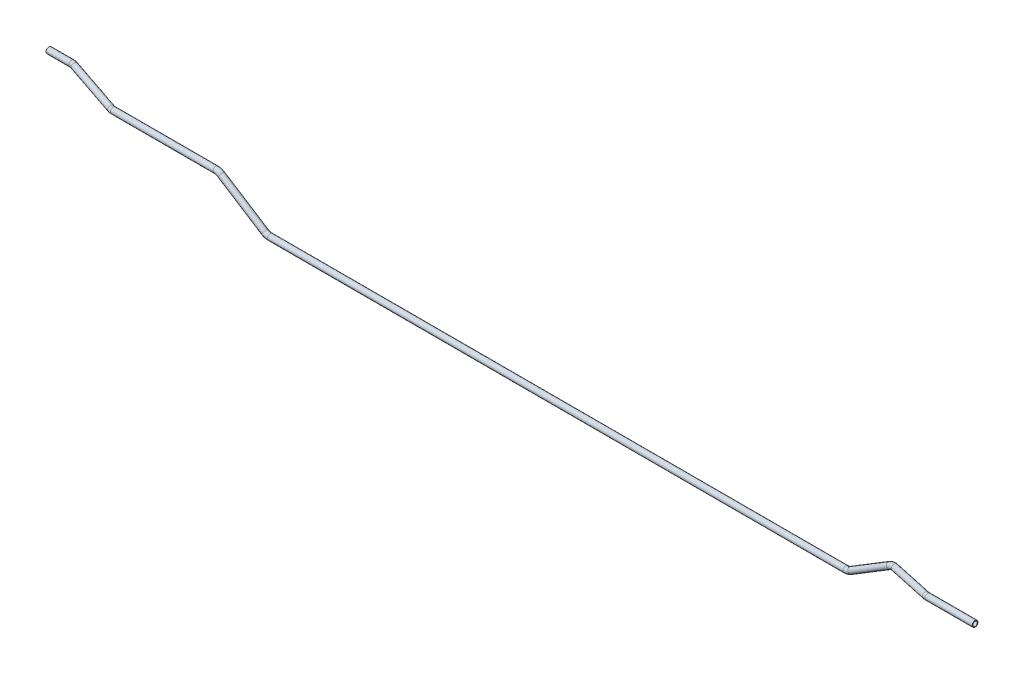
ISO-10303-21;
HEADER;
FILE_DESCRIPTION(('STEP AP214'),'2;1');
FILE_NAME('part.step','',(''),(''),'','','');
FILE_SCHEMA(('AUTOMOTIVE_DESIGN { 1 0 10303 214 1 1 1 1 }'));
ENDSEC;
DATA;
#1=APPLICATION_CONTEXT('core data for automotive mechanical design processes');
#2=APPLICATION_PROTOCOL_DEFINITION('international standard','automotive_design',2000,#1);
#3=PRODUCT_CONTEXT('',#1,'mechanical');
#4=PRODUCT('Part','Part','',(#3));
#5=PRODUCT_RELATED_PRODUCT_CATEGORY('part','',(#4));
#6=PRODUCT_DEFINITION_FORMATION('','',#4);
#7=PRODUCT_DEFINITION_CONTEXT('part definition',#1,'design');
#8=PRODUCT_DEFINITION('design','',#6,#7);
#9=PRODUCT_DEFINITION_SHAPE('','',#8);
#10=(LENGTH_UNIT() NAMED_UNIT(*) SI_UNIT(.MILLI.,.METRE.));
#11=(NAMED_UNIT(*) PLANE_ANGLE_UNIT() SI_UNIT($,.RADIAN.));
#12=(NAMED_UNIT(*) SI_UNIT($,.STERADIAN.) SOLID_ANGLE_UNIT());
#13=UNCERTAINTY_MEASURE_WITH_UNIT(LENGTH_MEASURE(1.E-05),#10,'distance_accuracy_value','');
#14=(GEOMETRIC_REPRESENTATION_CONTEXT(3) GLOBAL_UNCERTAINTY_ASSIGNED_CONTEXT((#13)) GLOBAL_UNIT_ASSIGNED_CONTEXT((#10,
#11,#12)) REPRESENTATION_CONTEXT('',''));
#15=CARTESIAN_POINT('',(0.,0.,0.));
#16=DIRECTION('',(0.,0.,1.));
#17=DIRECTION('',(1.,0.,0.));
#18=AXIS2_PLACEMENT_3D('',#15,#16,#17);
#19=CARTESIAN_POINT('',(1850.24890924357,-30.,39.4999999999999));
#20=DIRECTION('',(1.,0.,0.));
#21=DIRECTION('',(0.,0.,-1.));
#22=AXIS2_PLACEMENT_3D('',#19,#20,#21);
#23=CYLINDRICAL_SURFACE('',#22,6.);
#24=CARTESIAN_POINT('',(1850.24890924357,-30.,39.4999999999999));
#25=DIRECTION('',(1.,0.,0.));
#26=DIRECTION('',(0.,0.0602087645134184,-0.9981858066892));
#27=AXIS2_PLACEMENT_3D('',#24,#25,#26);
#28=CIRCLE('',#27,6.);
#29=CARTESIAN_POINT('',(1850.24890924357,-30.,45.4999999999999));
#30=VERTEX_POINT('',#29);
#31=EDGE_CURVE('E49',#30,#30,#28,.T.);
#32=ORIENTED_EDGE('',*,*,#31,.T.);
#33=EDGE_LOOP('',(#32));
#34=FACE_BOUND('',#33,.T.);
#35=CARTESIAN_POINT('',(1948.,-30.,39.4999999999999));
#36=DIRECTION('',(1.,0.,0.));
#37=DIRECTION('',(0.,0.0602087645134184,-0.9981858066892));
#38=AXIS2_PLACEMENT_3D('',#35,#36,#37);
#39=CIRCLE('',#38,6.);
#40=CARTESIAN_POINT('',(1948.,-29.6387474129195,33.5108851598647));
#41=VERTEX_POINT('',#40);
#42=EDGE_CURVE('E10',#41,#41,#39,.T.);
#43=ORIENTED_EDGE('',*,*,#42,.F.);
#44=EDGE_LOOP('',(#43));
#45=FACE_BOUND('',#44,.T.);
#46=ADVANCED_FACE('F39',(#34,#45),#23,.T.);
#47=CARTESIAN_POINT('',(1850.24890924357,-30.,39.4999999999999));
#48=DIRECTION('',(1.,0.,0.));
#49=DIRECTION('',(0.,0.,-1.));
#50=AXIS2_PLACEMENT_3D('',#47,#48,#49);
#51=CYLINDRICAL_SURFACE('',#50,4.5);
#52=CARTESIAN_POINT('',(1850.24890924357,-30.,39.4999999999999));
#53=DIRECTION('',(1.,0.,0.));
#54=DIRECTION('',(0.,0.0602087645134184,-0.9981858066892));
#55=AXIS2_PLACEMENT_3D('',#52,#53,#54);
#56=CIRCLE('',#55,4.5);
#57=CARTESIAN_POINT('',(1850.24890924357,-30.,43.9999999999999));
#58=VERTEX_POINT('',#57);
#59=EDGE_CURVE('E53',#58,#58,#56,.T.);
#60=ORIENTED_EDGE('',*,*,#59,.F.);
#61=EDGE_LOOP('',(#60));
#62=FACE_BOUND('',#61,.T.);
#63=CARTESIAN_POINT('',(1948.,-30.,39.4999999999999));
#64=DIRECTION('',(1.,0.,0.));
#65=DIRECTION('',(0.,0.0602087645134184,-0.9981858066892));
#66=AXIS2_PLACEMENT_3D('',#63,#64,#65);
#67=CIRCLE('',#66,4.5);
#68=CARTESIAN_POINT('',(1948.,-29.7290605596896,35.0081638698985));
#69=VERTEX_POINT('',#68);
#70=EDGE_CURVE('E45',#69,#69,#67,.T.);
#71=ORIENTED_EDGE('',*,*,#70,.T.);
#72=EDGE_LOOP('',(#71));
#73=FACE_BOUND('',#72,.T.);
#74=ADVANCED_FACE('F237',(#62,#73),#51,.F.);
#75=CARTESIAN_POINT('',(1850.24890924357,-30.,18.5));
#76=DIRECTION('',(0.,1.,0.));
#77=DIRECTION('',(0.,0.,1.));
#78=AXIS2_PLACEMENT_3D('',#75,#76,#77);
#79=TOROIDAL_SURFACE('',#78,20.9999999999999,6.);
#80=CARTESIAN_POINT('',(1845.80208895644,-30.,39.0237859405626));
#81=DIRECTION('',(0.977323140026797,0.,0.211753347005807));
#82=DIRECTION('',(0.211369185500129,0.0602087645134184,-0.97555008692367));
#83=AXIS2_PLACEMENT_3D('',#80,#81,#82);
#84=CIRCLE('',#83,6.);
#85=CARTESIAN_POINT('',(1844.53156887441,-30.,44.8877247807234));
#86=VERTEX_POINT('',#85);
#87=EDGE_CURVE('E58',#86,#86,#84,.T.);
#88=CARTESIAN_POINT('',(1850.24890924357,-30.,18.5));
#89=DIRECTION('',(0.,1.,0.));
#90=DIRECTION('',(0.,0.,1.));
#91=AXIS2_PLACEMENT_3D('',#88,#89,#90);
#92=CIRCLE('',#91,26.9999999999999);
#93=EDGE_CURVE('',#86,#30,#92,.T.);
#94=ORIENTED_EDGE('',*,*,#87,.T.);
#95=ORIENTED_EDGE('',*,*,#31,.F.);
#96=ORIENTED_EDGE('',*,*,#93,.T.);
#97=ORIENTED_EDGE('',*,*,#93,.F.);
#98=EDGE_LOOP('',(#94,#96,#95,#97));
#99=FACE_BOUND('',#98,.T.);
#100=ADVANCED_FACE('F233',(#99),#79,.T.);
#101=CARTESIAN_POINT('',(1850.24890924357,-30.,18.5));
#102=DIRECTION('',(0.,1.,0.));
#103=DIRECTION('',(0.,0.,1.));
#104=AXIS2_PLACEMENT_3D('',#101,#102,#103);
#105=TOROIDAL_SURFACE('',#104,20.9999999999999,4.5);
#106=CARTESIAN_POINT('',(1845.80208895644,-30.,39.0237859405626));
#107=DIRECTION('',(0.977323140026797,0.,0.211753347005807));
#108=DIRECTION('',(0.211369185500129,0.0602087645134184,-0.97555008692367));
#109=AXIS2_PLACEMENT_3D('',#106,#107,#108);
#110=CIRCLE('',#109,4.5);
#111=CARTESIAN_POINT('',(1844.84919889492,-30.,43.4217400706832));
#112=VERTEX_POINT('',#111);
#113=EDGE_CURVE('E61',#112,#112,#110,.T.);
#114=CARTESIAN_POINT('',(1850.24890924357,-30.,18.5));
#115=DIRECTION('',(0.,1.,0.));
#116=DIRECTION('',(0.,0.,1.));
#117=AXIS2_PLACEMENT_3D('',#114,#115,#116);
#118=CIRCLE('',#117,25.4999999999999);
#119=EDGE_CURVE('',#112,#58,#118,.T.);
#120=ORIENTED_EDGE('',*,*,#113,.F.);
#121=ORIENTED_EDGE('',*,*,#59,.T.);
#122=ORIENTED_EDGE('',*,*,#119,.T.);
#123=ORIENTED_EDGE('',*,*,#119,.F.);
#124=EDGE_LOOP('',(#120,#122,#121,#123));
#125=FACE_BOUND('',#124,.T.);
#126=ADVANCED_FACE('F230',(#125),#105,.F.);
#127=CARTESIAN_POINT('',(1764.1760204353,-30.,21.3381377609813));
#128=DIRECTION('',(0.977323140026798,0.,0.211753347005805));
#129=DIRECTION('',(0.211753347005805,0.,-0.977323140026798));
#130=AXIS2_PLACEMENT_3D('',#127,#128,#129);
#131=CYLINDRICAL_SURFACE('',#130,6.);
#132=CARTESIAN_POINT('',(1764.1760204353,-30.,21.3381377609813));
#133=DIRECTION('',(0.977323140026797,0.,0.211753347005807));
#134=DIRECTION('',(0.211369185500129,0.0602087645134184,-0.97555008692367));
#135=AXIS2_PLACEMENT_3D('',#132,#133,#134);
#136=CIRCLE('',#135,6.);
#137=CARTESIAN_POINT('',(1764.59199791712,-24.3307000595159,19.4182416910231));
#138=VERTEX_POINT('',#137);
#139=EDGE_CURVE('E64',#138,#138,#136,.T.);
#140=ORIENTED_EDGE('',*,*,#139,.T.);
#141=EDGE_LOOP('',(#140));
#142=FACE_BOUND('',#141,.T.);
#143=ORIENTED_EDGE('',*,*,#87,.F.);
#144=EDGE_LOOP('',(#143));
#145=FACE_BOUND('',#144,.T.);
#146=ADVANCED_FACE('F226',(#142,#145),#131,.T.);
#147=CARTESIAN_POINT('',(1764.1760204353,-30.,21.3381377609813));
#148=DIRECTION('',(0.977323140026798,0.,0.211753347005805));
#149=DIRECTION('',(0.211753347005805,0.,-0.977323140026798));
#150=AXIS2_PLACEMENT_3D('',#147,#148,#149);
#151=CYLINDRICAL_SURFACE('',#150,4.5);
#152=CARTESIAN_POINT('',(1764.1760204353,-30.,21.3381377609813));
#153=DIRECTION('',(0.977323140026797,0.,0.211753347005807));
#154=DIRECTION('',(0.211369185500129,0.0602087645134184,-0.97555008692367));
#155=AXIS2_PLACEMENT_3D('',#152,#153,#154);
#156=CIRCLE('',#155,4.5);
#157=CARTESIAN_POINT('',(1764.48800354667,-25.7480250446369,19.8982157085126));
#158=VERTEX_POINT('',#157);
#159=EDGE_CURVE('E67',#158,#158,#156,.T.);
#160=ORIENTED_EDGE('',*,*,#159,.F.);
#161=EDGE_LOOP('',(#160));
#162=FACE_BOUND('',#161,.T.);
#163=ORIENTED_EDGE('',*,*,#113,.T.);
#164=EDGE_LOOP('',(#163));
#165=FACE_BOUND('',#164,.T.);
#166=ADVANCED_FACE('F223',(#162,#165),#151,.F.);
#167=CARTESIAN_POINT('',(1762.72009924891,-49.8425497916947,28.057774005835));
#168=DIRECTION('',(0.200082206262887,-0.327407246612003,-0.923456336597959));
#169=DIRECTION('',(0.,0.942514822087113,-0.334164346012703));
#170=AXIS2_PLACEMENT_3D('',#167,#168,#169);
#171=TOROIDAL_SURFACE('',#170,20.9999999999999,6.);
#172=CARTESIAN_POINT('',(1752.60783662448,-33.2952109517084,20.));
#173=DIRECTION('',(0.853281833651957,0.521450009453978,0.));
#174=DIRECTION('',(0.,0.,-1.));
#175=AXIS2_PLACEMENT_3D('',#172,#173,#174);
#176=CIRCLE('',#175,6.);
#177=CARTESIAN_POINT('',(1749.71861873178,-28.5673998545695,17.6977788554757));
#178=VERTEX_POINT('',#177);
#179=EDGE_CURVE('E70',#178,#178,#176,.T.);
#180=CARTESIAN_POINT('',(1762.72009924891,-49.8425497916947,28.057774005835));
#181=DIRECTION('',(0.200082206262887,-0.327407246612003,-0.923456336597959));
#182=DIRECTION('',(0.,0.942514822087113,-0.334164346012703));
#183=AXIS2_PLACEMENT_3D('',#180,#181,#182);
#184=CIRCLE('',#183,26.9999999999999);
#185=EDGE_CURVE('',#178,#138,#184,.T.);
#186=ORIENTED_EDGE('',*,*,#179,.T.);
#187=ORIENTED_EDGE('',*,*,#139,.F.);
#188=ORIENTED_EDGE('',*,*,#185,.T.);
#189=ORIENTED_EDGE('',*,*,#185,.F.);
#190=EDGE_LOOP('',(#186,#188,#187,#189));
#191=FACE_BOUND('',#190,.T.);
#192=ADVANCED_FACE('F219',(#191),#171,.T.);
#193=CARTESIAN_POINT('',(1762.72009924891,-49.8425497916947,28.057774005835));
#194=DIRECTION('',(0.200082206262887,-0.327407246612003,-0.923456336597959));
#195=DIRECTION('',(0.,0.942514822087113,-0.334164346012703));
#196=AXIS2_PLACEMENT_3D('',#193,#194,#195);
#197=TOROIDAL_SURFACE('',#196,20.9999999999999,4.5);
#198=CARTESIAN_POINT('',(1752.60783662448,-33.2952109517084,20.));
#199=DIRECTION('',(0.853281833651957,0.521450009453978,0.));
#200=DIRECTION('',(0.,0.,-1.));
#201=AXIS2_PLACEMENT_3D('',#198,#199,#200);
#202=CIRCLE('',#201,4.5);
#203=CARTESIAN_POINT('',(1750.44092320496,-29.7493526288542,18.2733341416068));
#204=VERTEX_POINT('',#203);
#205=EDGE_CURVE('E73',#204,#204,#202,.T.);
#206=CARTESIAN_POINT('',(1762.72009924891,-49.8425497916947,28.057774005835));
#207=DIRECTION('',(0.200082206262887,-0.327407246612003,-0.923456336597959));
#208=DIRECTION('',(0.,0.942514822087113,-0.334164346012703));
#209=AXIS2_PLACEMENT_3D('',#206,#207,#208);
#210=CIRCLE('',#209,25.4999999999999);
#211=EDGE_CURVE('',#204,#158,#210,.T.);
#212=ORIENTED_EDGE('',*,*,#205,.F.);
#213=ORIENTED_EDGE('',*,*,#159,.T.);
#214=ORIENTED_EDGE('',*,*,#211,.T.);
#215=ORIENTED_EDGE('',*,*,#211,.F.);
#216=EDGE_LOOP('',(#212,#214,#213,#215));
#217=FACE_BOUND('',#216,.T.);
#218=ADVANCED_FACE('F216',(#217),#197,.F.);
#219=CARTESIAN_POINT('',(1673.04176971632,-81.9189185066912,20.));
#220=DIRECTION('',(0.853281833651959,0.521450009453975,0.));
#221=DIRECTION('',(-0.521450009453975,0.853281833651959,0.));
#222=AXIS2_PLACEMENT_3D('',#219,#220,#221);
#223=CYLINDRICAL_SURFACE('',#222,6.);
#224=CARTESIAN_POINT('',(1673.04176971632,-81.9189185066912,20.));
#225=DIRECTION('',(0.853281833651957,0.521450009453978,0.));
#226=DIRECTION('',(0.,0.,-1.));
#227=AXIS2_PLACEMENT_3D('',#224,#225,#226);
#228=CIRCLE('',#227,6.);
#229=CARTESIAN_POINT('',(1676.17046977305,-87.038609508603,20.));
#230=VERTEX_POINT('',#229);
#231=EDGE_CURVE('E76',#230,#230,#228,.T.);
#232=ORIENTED_EDGE('',*,*,#231,.T.);
#233=EDGE_LOOP('',(#232));
#234=FACE_BOUND('',#233,.T.);
#235=ORIENTED_EDGE('',*,*,#179,.F.);
#236=EDGE_LOOP('',(#235));
#237=FACE_BOUND('',#236,.T.);
#238=ADVANCED_FACE('F212',(#234,#237),#223,.T.);
#239=CARTESIAN_POINT('',(1673.04176971632,-81.9189185066912,20.));
#240=DIRECTION('',(0.853281833651959,0.521450009453975,0.));
#241=DIRECTION('',(-0.521450009453975,0.853281833651959,0.));
#242=AXIS2_PLACEMENT_3D('',#239,#240,#241);
#243=CYLINDRICAL_SURFACE('',#242,4.5);
#244=CARTESIAN_POINT('',(1673.04176971632,-81.9189185066912,20.));
#245=DIRECTION('',(0.853281833651957,0.521450009453978,0.));
#246=DIRECTION('',(0.,0.,-1.));
#247=AXIS2_PLACEMENT_3D('',#244,#245,#246);
#248=CIRCLE('',#247,4.5);
#249=CARTESIAN_POINT('',(1675.38829475887,-85.7586867581251,20.));
#250=VERTEX_POINT('',#249);
#251=EDGE_CURVE('E79',#250,#250,#248,.T.);
#252=ORIENTED_EDGE('',*,*,#251,.F.);
#253=EDGE_LOOP('',(#252));
#254=FACE_BOUND('',#253,.T.);
#255=ORIENTED_EDGE('',*,*,#205,.T.);
#256=EDGE_LOOP('',(#255));
#257=FACE_BOUND('',#256,.T.);
#258=ADVANCED_FACE('F209',(#254,#257),#243,.F.);
#259=CARTESIAN_POINT('',(1662.09131951779,-64.,20.));
#260=DIRECTION('',(0.,0.,1.));
#261=DIRECTION('',(1.,0.,0.));
#262=AXIS2_PLACEMENT_3D('',#259,#260,#261);
#263=TOROIDAL_SURFACE('',#262,21.0000000000001,6.);
#264=CARTESIAN_POINT('',(1662.09131951779,-85.0000000000001,20.));
#265=DIRECTION('',(1.,0.,0.));
#266=DIRECTION('',(0.,0.,-1.));
#267=AXIS2_PLACEMENT_3D('',#264,#265,#266);
#268=CIRCLE('',#267,6.);
#269=CARTESIAN_POINT('',(1662.09131951779,-91.0000000000001,20.));
#270=VERTEX_POINT('',#269);
#271=EDGE_CURVE('E82',#270,#270,#268,.T.);
#272=CARTESIAN_POINT('',(1662.09131951779,-64.,20.));
#273=DIRECTION('',(0.,0.,1.));
#274=DIRECTION('',(1.,0.,0.));
#275=AXIS2_PLACEMENT_3D('',#272,#273,#274);
#276=CIRCLE('',#275,27.0000000000001);
#277=EDGE_CURVE('',#270,#230,#276,.T.);
#278=ORIENTED_EDGE('',*,*,#271,.T.);
#279=ORIENTED_EDGE('',*,*,#231,.F.);
#280=ORIENTED_EDGE('',*,*,#277,.T.);
#281=ORIENTED_EDGE('',*,*,#277,.F.);
#282=EDGE_LOOP('',(#278,#280,#279,#281));
#283=FACE_BOUND('',#282,.T.);
#284=ADVANCED_FACE('F205',(#283),#263,.T.);
#285=CARTESIAN_POINT('',(1662.09131951779,-64.,20.));
#286=DIRECTION('',(0.,0.,1.));
#287=DIRECTION('',(1.,0.,0.));
#288=AXIS2_PLACEMENT_3D('',#285,#286,#287);
#289=TOROIDAL_SURFACE('',#288,21.0000000000001,4.5);
#290=CARTESIAN_POINT('',(1662.09131951779,-85.0000000000001,20.));
#291=DIRECTION('',(1.,0.,0.));
#292=DIRECTION('',(0.,0.,-1.));
#293=AXIS2_PLACEMENT_3D('',#290,#291,#292);
#294=CIRCLE('',#293,4.5);
#295=CARTESIAN_POINT('',(1662.09131951779,-89.5000000000001,20.));
#296=VERTEX_POINT('',#295);
#297=EDGE_CURVE('E85',#296,#296,#294,.T.);
#298=CARTESIAN_POINT('',(1662.09131951779,-64.,20.));
#299=DIRECTION('',(0.,0.,1.));
#300=DIRECTION('',(1.,0.,0.));
#301=AXIS2_PLACEMENT_3D('',#298,#299,#300);
#302=CIRCLE('',#301,25.5000000000001);
#303=EDGE_CURVE('',#296,#250,#302,.T.);
#304=ORIENTED_EDGE('',*,*,#297,.F.);
#305=ORIENTED_EDGE('',*,*,#251,.T.);
#306=ORIENTED_EDGE('',*,*,#303,.T.);
#307=ORIENTED_EDGE('',*,*,#303,.F.);
#308=EDGE_LOOP('',(#304,#306,#305,#307));
#309=FACE_BOUND('',#308,.T.);
#310=ADVANCED_FACE('F202',(#309),#289,.F.);
#311=CARTESIAN_POINT('',(476.144657959096,-85.0000000000001,20.));
#312=DIRECTION('',(1.,0.,0.));
#313=DIRECTION('',(0.,0.,-1.));
#314=AXIS2_PLACEMENT_3D('',#311,#312,#313);
#315=CYLINDRICAL_SURFACE('',#314,6.);
#316=CARTESIAN_POINT('',(476.144657959096,-85.0000000000001,20.));
#317=DIRECTION('',(1.,0.,0.));
#318=DIRECTION('',(0.,0.,-1.));
#319=AXIS2_PLACEMENT_3D('',#316,#317,#318);
#320=CIRCLE('',#319,6.);
#321=CARTESIAN_POINT('',(476.144657959096,-91.,20.));
#322=VERTEX_POINT('',#321);
#323=EDGE_CURVE('E88',#322,#322,#320,.T.);
#324=ORIENTED_EDGE('',*,*,#323,.T.);
#325=EDGE_LOOP('',(#324));
#326=FACE_BOUND('',#325,.T.);
#327=ORIENTED_EDGE('',*,*,#271,.F.);
#328=EDGE_LOOP('',(#327));
#329=FACE_BOUND('',#328,.T.);
#330=ADVANCED_FACE('F198',(#326,#329),#315,.T.);
#331=CARTESIAN_POINT('',(476.144657959096,-85.0000000000001,20.));
#332=DIRECTION('',(1.,0.,0.));
#333=DIRECTION('',(0.,0.,-1.));
#334=AXIS2_PLACEMENT_3D('',#331,#332,#333);
#335=CYLINDRICAL_SURFACE('',#334,4.5);
#336=CARTESIAN_POINT('',(476.144657959096,-85.0000000000001,20.));
#337=DIRECTION('',(1.,0.,0.));
#338=DIRECTION('',(0.,0.,-1.));
#339=AXIS2_PLACEMENT_3D('',#336,#337,#338);
#340=CIRCLE('',#339,4.5);
#341=CARTESIAN_POINT('',(476.144657959096,-89.5,20.));
#342=VERTEX_POINT('',#341);
#343=EDGE_CURVE('E91',#342,#342,#340,.T.);
#344=ORIENTED_EDGE('',*,*,#343,.F.);
#345=EDGE_LOOP('',(#344));
#346=FACE_BOUND('',#345,.T.);
#347=ORIENTED_EDGE('',*,*,#297,.T.);
#348=EDGE_LOOP('',(#347));
#349=FACE_BOUND('',#348,.T.);
#350=ADVANCED_FACE('F195',(#346,#349),#335,.F.);
#351=CARTESIAN_POINT('',(476.144657959096,-64.,20.));
#352=DIRECTION('',(0.,0.,1.));
#353=DIRECTION('',(1.,0.,0.));
#354=AXIS2_PLACEMENT_3D('',#351,#352,#353);
#355=TOROIDAL_SURFACE('',#354,21.,6.);
#356=CARTESIAN_POINT('',(464.824530334206,-81.6876994138917,20.));
#357=DIRECTION('',(0.842271400661511,-0.539053696423368,0.));
#358=DIRECTION('',(0.,0.,-1.));
#359=AXIS2_PLACEMENT_3D('',#356,#357,#358);
#360=CIRCLE('',#359,6.);
#361=CARTESIAN_POINT('',(461.590208155666,-86.7413278178608,20.));
#362=VERTEX_POINT('',#361);
#363=EDGE_CURVE('E94',#362,#362,#360,.T.);
#364=CARTESIAN_POINT('',(476.144657959096,-64.,20.));
#365=DIRECTION('',(0.,0.,1.));
#366=DIRECTION('',(1.,0.,0.));
#367=AXIS2_PLACEMENT_3D('',#364,#365,#366);
#368=CIRCLE('',#367,27.);
#369=EDGE_CURVE('',#362,#322,#368,.T.);
#370=ORIENTED_EDGE('',*,*,#363,.T.);
#371=ORIENTED_EDGE('',*,*,#323,.F.);
#372=ORIENTED_EDGE('',*,*,#369,.T.);
#373=ORIENTED_EDGE('',*,*,#369,.F.);
#374=EDGE_LOOP('',(#370,#372,#371,#373));
#375=FACE_BOUND('',#374,.T.);
#376=ADVANCED_FACE('F191',(#375),#355,.T.);
#377=CARTESIAN_POINT('',(476.144657959096,-64.,20.));
#378=DIRECTION('',(0.,0.,1.));
#379=DIRECTION('',(1.,0.,0.));
#380=AXIS2_PLACEMENT_3D('',#377,#378,#379);
#381=TOROIDAL_SURFACE('',#380,21.,4.5);
#382=CARTESIAN_POINT('',(464.824530334206,-81.6876994138917,20.));
#383=DIRECTION('',(0.842271400661511,-0.539053696423368,0.));
#384=DIRECTION('',(0.,0.,-1.));
#385=AXIS2_PLACEMENT_3D('',#382,#383,#384);
#386=CIRCLE('',#385,4.5);
#387=CARTESIAN_POINT('',(462.398788700301,-85.4779207168686,20.));
#388=VERTEX_POINT('',#387);
#389=EDGE_CURVE('E97',#388,#388,#386,.T.);
#390=CARTESIAN_POINT('',(476.144657959096,-64.,20.));
#391=DIRECTION('',(0.,0.,1.));
#392=DIRECTION('',(1.,0.,0.));
#393=AXIS2_PLACEMENT_3D('',#390,#391,#392);
#394=CIRCLE('',#393,25.5);
#395=EDGE_CURVE('',#388,#342,#394,.T.);
#396=ORIENTED_EDGE('',*,*,#389,.F.);
#397=ORIENTED_EDGE('',*,*,#343,.T.);
#398=ORIENTED_EDGE('',*,*,#395,.T.);
#399=ORIENTED_EDGE('',*,*,#395,.F.);
#400=EDGE_LOOP('',(#396,#398,#397,#399));
#401=FACE_BOUND('',#400,.T.);
#402=ADVANCED_FACE('F188',(#401),#381,.F.);
#403=CARTESIAN_POINT('',(375.175469665794,-24.3123005861083,20.));
#404=DIRECTION('',(0.842271400661511,-0.539053696423367,0.));
#405=DIRECTION('',(0.539053696423367,0.842271400661511,0.));
#406=AXIS2_PLACEMENT_3D('',#403,#404,#405);
#407=CYLINDRICAL_SURFACE('',#406,6.);
#408=CARTESIAN_POINT('',(375.175469665794,-24.3123005861083,20.));
#409=DIRECTION('',(0.842271400661511,-0.539053696423368,0.));
#410=DIRECTION('',(0.,0.,-1.));
#411=AXIS2_PLACEMENT_3D('',#408,#409,#410);
#412=CIRCLE('',#411,6.);
#413=CARTESIAN_POINT('',(378.409791844334,-19.2586721821391,20.));
#414=VERTEX_POINT('',#413);
#415=EDGE_CURVE('E100',#414,#414,#412,.T.);
#416=ORIENTED_EDGE('',*,*,#415,.T.);
#417=EDGE_LOOP('',(#416));
#418=FACE_BOUND('',#417,.T.);
#419=ORIENTED_EDGE('',*,*,#363,.F.);
#420=EDGE_LOOP('',(#419));
#421=FACE_BOUND('',#420,.T.);
#422=ADVANCED_FACE('F184',(#418,#421),#407,.T.);
#423=CARTESIAN_POINT('',(375.175469665794,-24.3123005861083,20.));
#424=DIRECTION('',(0.842271400661511,-0.539053696423367,0.));
#425=DIRECTION('',(0.539053696423367,0.842271400661511,0.));
#426=AXIS2_PLACEMENT_3D('',#423,#424,#425);
#427=CYLINDRICAL_SURFACE('',#426,4.5);
#428=CARTESIAN_POINT('',(375.175469665794,-24.3123005861083,20.));
#429=DIRECTION('',(0.842271400661511,-0.539053696423368,0.));
#430=DIRECTION('',(0.,0.,-1.));
#431=AXIS2_PLACEMENT_3D('',#428,#429,#430);
#432=CIRCLE('',#431,4.5);
#433=CARTESIAN_POINT('',(377.601211299699,-20.5220792831314,20.));
#434=VERTEX_POINT('',#433);
#435=EDGE_CURVE('E103',#434,#434,#432,.T.);
#436=ORIENTED_EDGE('',*,*,#435,.F.);
#437=EDGE_LOOP('',(#436));
#438=FACE_BOUND('',#437,.T.);
#439=ORIENTED_EDGE('',*,*,#389,.T.);
#440=EDGE_LOOP('',(#439));
#441=FACE_BOUND('',#440,.T.);
#442=ADVANCED_FACE('F181',(#438,#441),#427,.F.);
#443=CARTESIAN_POINT('',(363.855342040903,-42.,20.));
#444=DIRECTION('',(0.,0.,-1.));
#445=DIRECTION('',(-1.,0.,0.));
#446=AXIS2_PLACEMENT_3D('',#443,#444,#445);
#447=TOROIDAL_SURFACE('',#446,21.,6.);
#448=CARTESIAN_POINT('',(363.855342040903,-21.,20.));
#449=DIRECTION('',(1.,0.,0.));
#450=DIRECTION('',(0.,0.,-1.));
#451=AXIS2_PLACEMENT_3D('',#448,#449,#450);
#452=CIRCLE('',#451,6.);
#453=CARTESIAN_POINT('',(363.855342040903,-15.,20.));
#454=VERTEX_POINT('',#453);
#455=EDGE_CURVE('E106',#454,#454,#452,.T.);
#456=CARTESIAN_POINT('',(363.855342040903,-42.,20.));
#457=DIRECTION('',(0.,0.,-1.));
#458=DIRECTION('',(-1.,0.,0.));
#459=AXIS2_PLACEMENT_3D('',#456,#457,#458);
#460=CIRCLE('',#459,27.);
#461=EDGE_CURVE('',#454,#414,#460,.T.);
#462=ORIENTED_EDGE('',*,*,#455,.T.);
#463=ORIENTED_EDGE('',*,*,#415,.F.);
#464=ORIENTED_EDGE('',*,*,#461,.T.);
#465=ORIENTED_EDGE('',*,*,#461,.F.);
#466=EDGE_LOOP('',(#462,#464,#463,#465));
#467=FACE_BOUND('',#466,.T.);
#468=ADVANCED_FACE('F177',(#467),#447,.T.);
#469=CARTESIAN_POINT('',(363.855342040903,-42.,20.));
#470=DIRECTION('',(0.,0.,-1.));
#471=DIRECTION('',(-1.,0.,0.));
#472=AXIS2_PLACEMENT_3D('',#469,#470,#471);
#473=TOROIDAL_SURFACE('',#472,21.,4.5);
#474=CARTESIAN_POINT('',(363.855342040903,-21.,20.));
#475=DIRECTION('',(1.,0.,0.));
#476=DIRECTION('',(0.,0.,-1.));
#477=AXIS2_PLACEMENT_3D('',#474,#475,#476);
#478=CIRCLE('',#477,4.5);
#479=CARTESIAN_POINT('',(363.855342040903,-16.5,20.));
#480=VERTEX_POINT('',#479);
#481=EDGE_CURVE('E109',#480,#480,#478,.T.);
#482=CARTESIAN_POINT('',(363.855342040903,-42.,20.));
#483=DIRECTION('',(0.,0.,-1.));
#484=DIRECTION('',(-1.,0.,0.));
#485=AXIS2_PLACEMENT_3D('',#482,#483,#484);
#486=CIRCLE('',#485,25.5);
#487=EDGE_CURVE('',#480,#434,#486,.T.);
#488=ORIENTED_EDGE('',*,*,#481,.F.);
#489=ORIENTED_EDGE('',*,*,#435,.T.);
#490=ORIENTED_EDGE('',*,*,#487,.T.);
#491=ORIENTED_EDGE('',*,*,#487,.F.);
#492=EDGE_LOOP('',(#488,#490,#489,#491));
#493=FACE_BOUND('',#492,.T.);
#494=ADVANCED_FACE('F174',(#493),#473,.F.);
#495=CARTESIAN_POINT('',(152.98353729776,-21.,20.));
#496=DIRECTION('',(1.,0.,0.));
#497=DIRECTION('',(0.,0.,-1.));
#498=AXIS2_PLACEMENT_3D('',#495,#496,#497);
#499=CYLINDRICAL_SURFACE('',#498,6.);
#500=CARTESIAN_POINT('',(152.98353729776,-21.,20.));
#501=DIRECTION('',(1.,0.,0.));
#502=DIRECTION('',(0.,0.,-1.));
#503=AXIS2_PLACEMENT_3D('',#500,#501,#502);
#504=CIRCLE('',#503,6.);
#505=CARTESIAN_POINT('',(152.98353729776,-25.3448275862069,24.1379310344828));
#506=VERTEX_POINT('',#505);
#507=EDGE_CURVE('E112',#506,#506,#504,.T.);
#508=ORIENTED_EDGE('',*,*,#507,.T.);
#509=EDGE_LOOP('',(#508));
#510=FACE_BOUND('',#509,.T.);
#511=ORIENTED_EDGE('',*,*,#455,.F.);
#512=EDGE_LOOP('',(#511));
#513=FACE_BOUND('',#512,.T.);
#514=ADVANCED_FACE('F170',(#510,#513),#499,.T.);
#515=CARTESIAN_POINT('',(152.98353729776,-21.,20.));
#516=DIRECTION('',(1.,0.,0.));
#517=DIRECTION('',(0.,0.,-1.));
#518=AXIS2_PLACEMENT_3D('',#515,#516,#517);
#519=CYLINDRICAL_SURFACE('',#518,4.5);
#520=CARTESIAN_POINT('',(152.98353729776,-21.,20.));
#521=DIRECTION('',(1.,0.,0.));
#522=DIRECTION('',(0.,0.,-1.));
#523=AXIS2_PLACEMENT_3D('',#520,#521,#522);
#524=CIRCLE('',#523,4.5);
#525=CARTESIAN_POINT('',(152.98353729776,-24.2586206896552,23.1034482758621));
#526=VERTEX_POINT('',#525);
#527=EDGE_CURVE('E115',#526,#526,#524,.T.);
#528=ORIENTED_EDGE('',*,*,#527,.F.);
#529=EDGE_LOOP('',(#528));
#530=FACE_BOUND('',#529,.T.);
#531=ORIENTED_EDGE('',*,*,#481,.T.);
#532=EDGE_LOOP('',(#531));
#533=FACE_BOUND('',#532,.T.);
#534=ADVANCED_FACE('F167',(#530,#533),#519,.F.);
#535=CARTESIAN_POINT('',(152.98353729776,-5.79310344827585,5.51724137931036));
#536=DIRECTION('',(0.,0.689655172413792,0.724137931034484));
#537=DIRECTION('',(0.,-0.724137931034484,0.689655172413792));
#538=AXIS2_PLACEMENT_3D('',#535,#536,#537);
#539=TOROIDAL_SURFACE('',#538,21.,6.);
#540=CARTESIAN_POINT('',(147.134523842598,-20.3982500069456,19.4269047685196));
#541=DIRECTION('',(0.960429138778732,-0.201690119143535,0.192085827755747));
#542=DIRECTION('',(0.192085827755747,-0.0197619045338082,-0.98117913853923));
#543=AXIS2_PLACEMENT_3D('',#540,#541,#542);
#544=CIRCLE('',#543,6.);
#545=CARTESIAN_POINT('',(145.463377141123,-24.5711490237083,23.4010943082936));
#546=VERTEX_POINT('',#545);
#547=EDGE_CURVE('E118',#546,#546,#544,.T.);
#548=CARTESIAN_POINT('',(152.98353729776,-5.79310344827585,5.51724137931036));
#549=DIRECTION('',(0.,0.689655172413792,0.724137931034484));
#550=DIRECTION('',(0.,-0.724137931034484,0.689655172413792));
#551=AXIS2_PLACEMENT_3D('',#548,#549,#550);
#552=CIRCLE('',#551,27.);
#553=EDGE_CURVE('',#546,#506,#552,.T.);
#554=ORIENTED_EDGE('',*,*,#547,.T.);
#555=ORIENTED_EDGE('',*,*,#507,.F.);
#556=ORIENTED_EDGE('',*,*,#553,.T.);
#557=ORIENTED_EDGE('',*,*,#553,.F.);
#558=EDGE_LOOP('',(#554,#556,#555,#557));
#559=FACE_BOUND('',#558,.T.);
#560=ADVANCED_FACE('F163',(#559),#539,.T.);
#561=CARTESIAN_POINT('',(152.98353729776,-5.79310344827585,5.51724137931036));
#562=DIRECTION('',(0.,0.689655172413792,0.724137931034484));
#563=DIRECTION('',(0.,-0.724137931034484,0.689655172413792));
#564=AXIS2_PLACEMENT_3D('',#561,#562,#563);
#565=TOROIDAL_SURFACE('',#564,21.,4.5);
#566=CARTESIAN_POINT('',(147.134523842598,-20.3982500069456,19.4269047685196));
#567=DIRECTION('',(0.960429138778732,-0.201690119143535,0.192085827755747));
#568=DIRECTION('',(0.192085827755747,-0.0197619045338082,-0.98117913853923));
#569=AXIS2_PLACEMENT_3D('',#566,#567,#568);
#570=CIRCLE('',#569,4.5);
#571=CARTESIAN_POINT('',(145.881163816492,-23.5279242695176,22.4075469233501));
#572=VERTEX_POINT('',#571);
#573=EDGE_CURVE('E121',#572,#572,#570,.T.);
#574=CARTESIAN_POINT('',(152.98353729776,-5.79310344827585,5.51724137931036));
#575=DIRECTION('',(0.,0.689655172413792,0.724137931034484));
#576=DIRECTION('',(0.,-0.724137931034484,0.689655172413792));
#577=AXIS2_PLACEMENT_3D('',#574,#575,#576);
#578=CIRCLE('',#577,25.5);
#579=EDGE_CURVE('',#572,#526,#578,.T.);
#580=ORIENTED_EDGE('',*,*,#573,.F.);
#581=ORIENTED_EDGE('',*,*,#527,.T.);
#582=ORIENTED_EDGE('',*,*,#579,.T.);
#583=ORIENTED_EDGE('',*,*,#579,.F.);
#584=EDGE_LOOP('',(#580,#582,#581,#583));
#585=FACE_BOUND('',#584,.T.);
#586=ADVANCED_FACE('F160',(#585),#565,.F.);
#587=CARTESIAN_POINT('',(52.8654761574022,-0.601749993054459,0.573095231480436));
#588=DIRECTION('',(0.960429138778732,-0.201690119143534,0.192085827755746));
#589=DIRECTION('',(0.205517234286414,0.978653496601971,0.));
#590=AXIS2_PLACEMENT_3D('',#587,#588,#589);
#591=CYLINDRICAL_SURFACE('',#590,6.);
#592=CARTESIAN_POINT('',(52.8654761574022,-0.601749993054459,0.573095231480436));
#593=DIRECTION('',(0.960429138778732,-0.201690119143535,0.192085827755747));
#594=DIRECTION('',(0.192085827755747,-0.0197619045338082,-0.98117913853923));
#595=AXIS2_PLACEMENT_3D('',#592,#593,#594);
#596=CIRCLE('',#595,6.);
#597=CARTESIAN_POINT('',(54.5366228588772,3.5711490237083,-3.40109430829362));
#598=VERTEX_POINT('',#597);
#599=EDGE_CURVE('E124',#598,#598,#596,.T.);
#600=ORIENTED_EDGE('',*,*,#599,.T.);
#601=EDGE_LOOP('',(#600));
#602=FACE_BOUND('',#601,.T.);
#603=ORIENTED_EDGE('',*,*,#547,.F.);
#604=EDGE_LOOP('',(#603));
#605=FACE_BOUND('',#604,.T.);
#606=ADVANCED_FACE('F156',(#602,#605),#591,.T.);
#607=CARTESIAN_POINT('',(52.8654761574022,-0.601749993054459,0.573095231480436));
#608=DIRECTION('',(0.960429138778732,-0.201690119143534,0.192085827755746));
#609=DIRECTION('',(0.205517234286414,0.978653496601971,0.));
#610=AXIS2_PLACEMENT_3D('',#607,#608,#609);
#611=CYLINDRICAL_SURFACE('',#610,4.5);
#612=CARTESIAN_POINT('',(52.8654761574022,-0.601749993054459,0.573095231480436));
#613=DIRECTION('',(0.960429138778732,-0.201690119143535,0.192085827755747));
#614=DIRECTION('',(0.192085827755747,-0.0197619045338082,-0.98117913853923));
#615=AXIS2_PLACEMENT_3D('',#612,#613,#614);
#616=CIRCLE('',#615,4.5);
#617=CARTESIAN_POINT('',(54.1188361835084,2.52792426951761,-2.40754692335011));
#618=VERTEX_POINT('',#617);
#619=EDGE_CURVE('E127',#618,#618,#616,.T.);
#620=ORIENTED_EDGE('',*,*,#619,.F.);
#621=EDGE_LOOP('',(#620));
#622=FACE_BOUND('',#621,.T.);
#623=ORIENTED_EDGE('',*,*,#573,.T.);
#624=EDGE_LOOP('',(#623));
#625=FACE_BOUND('',#624,.T.);
#626=ADVANCED_FACE('F153',(#622,#625),#611,.F.);
#627=CARTESIAN_POINT('',(47.0164627022397,-15.2068965517241,14.4827586206897));
#628=DIRECTION('',(0.,-0.689655172413793,-0.724137931034483));
#629=DIRECTION('',(0.,0.724137931034483,-0.689655172413793));
#630=AXIS2_PLACEMENT_3D('',#627,#628,#629);
#631=TOROIDAL_SURFACE('',#630,21.,6.);
#632=CARTESIAN_POINT('',(47.0164627022397,0.,0.));
#633=DIRECTION('',(1.,0.,0.));
#634=DIRECTION('',(0.,0.,-1.));
#635=AXIS2_PLACEMENT_3D('',#632,#633,#634);
#636=CIRCLE('',#635,6.);
#637=CARTESIAN_POINT('',(47.0164627022397,4.3448275862069,-4.13793103448276));
#638=VERTEX_POINT('',#637);
#639=EDGE_CURVE('E130',#638,#638,#636,.T.);
#640=CARTESIAN_POINT('',(47.0164627022397,-15.2068965517241,14.4827586206897));
#641=DIRECTION('',(0.,-0.689655172413793,-0.724137931034483));
#642=DIRECTION('',(0.,0.724137931034483,-0.689655172413793));
#643=AXIS2_PLACEMENT_3D('',#640,#641,#642);
#644=CIRCLE('',#643,27.);
#645=EDGE_CURVE('',#638,#598,#644,.T.);
#646=ORIENTED_EDGE('',*,*,#639,.T.);
#647=ORIENTED_EDGE('',*,*,#599,.F.);
#648=ORIENTED_EDGE('',*,*,#645,.T.);
#649=ORIENTED_EDGE('',*,*,#645,.F.);
#650=EDGE_LOOP('',(#646,#648,#647,#649));
#651=FACE_BOUND('',#650,.T.);
#652=ADVANCED_FACE('F149',(#651),#631,.T.);
#653=CARTESIAN_POINT('',(47.0164627022397,-15.2068965517241,14.4827586206897));
#654=DIRECTION('',(0.,-0.689655172413793,-0.724137931034483));
#655=DIRECTION('',(0.,0.724137931034483,-0.689655172413793));
#656=AXIS2_PLACEMENT_3D('',#653,#654,#655);
#657=TOROIDAL_SURFACE('',#656,21.,4.5);
#658=CARTESIAN_POINT('',(47.0164627022397,0.,0.));
#659=DIRECTION('',(1.,0.,0.));
#660=DIRECTION('',(0.,0.,-1.));
#661=AXIS2_PLACEMENT_3D('',#658,#659,#660);
#662=CIRCLE('',#661,4.5);
#663=CARTESIAN_POINT('',(47.0164627022397,3.25862068965518,-3.10344827586207));
#664=VERTEX_POINT('',#663);
#665=EDGE_CURVE('E134',#664,#664,#662,.T.);
#666=CARTESIAN_POINT('',(47.0164627022397,-15.2068965517241,14.4827586206897));
#667=DIRECTION('',(0.,-0.689655172413793,-0.724137931034483));
#668=DIRECTION('',(0.,0.724137931034483,-0.689655172413793));
#669=AXIS2_PLACEMENT_3D('',#666,#667,#668);
#670=CIRCLE('',#669,25.5);
#671=EDGE_CURVE('',#664,#618,#670,.T.);
#672=ORIENTED_EDGE('',*,*,#665,.F.);
#673=ORIENTED_EDGE('',*,*,#619,.T.);
#674=ORIENTED_EDGE('',*,*,#671,.T.);
#675=ORIENTED_EDGE('',*,*,#671,.F.);
#676=EDGE_LOOP('',(#672,#674,#673,#675));
#677=FACE_BOUND('',#676,.T.);
#678=ADVANCED_FACE('F146',(#677),#657,.F.);
#679=CARTESIAN_POINT('',(47.0164627022397,0.,0.));
#680=DIRECTION('',(-1.,0.,0.));
#681=DIRECTION('',(0.,0.,1.));
#682=AXIS2_PLACEMENT_3D('',#679,#680,#681);
#683=CYLINDRICAL_SURFACE('',#682,4.5);
#684=ORIENTED_EDGE('',*,*,#665,.T.);
#685=EDGE_LOOP('',(#684));
#686=FACE_BOUND('',#685,.T.);
#687=CARTESIAN_POINT('',(0.,0.,0.));
#688=DIRECTION('',(1.,0.,0.));
#689=DIRECTION('',(0.,0.,-1.));
#690=AXIS2_PLACEMENT_3D('',#687,#688,#689);
#691=CIRCLE('',#690,4.5);
#692=CARTESIAN_POINT('',(0.,0.,-4.5));
#693=VERTEX_POINT('',#692);
#694=EDGE_CURVE('E135',#693,#693,#691,.T.);
#695=ORIENTED_EDGE('',*,*,#694,.F.);
#696=EDGE_LOOP('',(#695));
#697=FACE_BOUND('',#696,.T.);
#698=ADVANCED_FACE('F143',(#686,#697),#683,.F.);
#699=CARTESIAN_POINT('',(47.0164627022397,0.,0.));
#700=DIRECTION('',(-1.,0.,0.));
#701=DIRECTION('',(0.,0.,1.));
#702=AXIS2_PLACEMENT_3D('',#699,#700,#701);
#703=CYLINDRICAL_SURFACE('',#702,6.);
#704=ORIENTED_EDGE('',*,*,#639,.F.);
#705=EDGE_LOOP('',(#704));
#706=FACE_BOUND('',#705,.T.);
#707=CARTESIAN_POINT('',(0.,0.,0.));
#708=DIRECTION('',(1.,0.,0.));
#709=DIRECTION('',(0.,0.,-1.));
#710=AXIS2_PLACEMENT_3D('',#707,#708,#709);
#711=CIRCLE('',#710,6.);
#712=CARTESIAN_POINT('',(0.,0.,-6.));
#713=VERTEX_POINT('',#712);
#714=EDGE_CURVE('E131',#713,#713,#711,.T.);
#715=ORIENTED_EDGE('',*,*,#714,.T.);
#716=EDGE_LOOP('',(#715));
#717=FACE_BOUND('',#716,.T.);
#718=ADVANCED_FACE('F285',(#706,#717),#703,.T.);
#719=CARTESIAN_POINT('',(1948.,-30.,39.4999999999999));
#720=DIRECTION('',(1.,0.,0.));
#721=DIRECTION('',(0.,0.0602087645134184,-0.9981858066892));
#722=AXIS2_PLACEMENT_3D('',#719,#720,#721);
#723=PLANE('',#722);
#724=ORIENTED_EDGE('',*,*,#70,.F.);
#725=EDGE_LOOP('',(#724));
#726=FACE_BOUND('',#725,.T.);
#727=ORIENTED_EDGE('',*,*,#42,.T.);
#728=EDGE_LOOP('',(#727));
#729=FACE_BOUND('',#728,.T.);
#730=ADVANCED_FACE('F288',(#726,#729),#723,.T.);
#731=CARTESIAN_POINT('',(0.,0.,0.));
#732=DIRECTION('',(1.,0.,0.));
#733=DIRECTION('',(0.,0.,-1.));
#734=AXIS2_PLACEMENT_3D('',#731,#732,#733);
#735=PLANE('',#734);
#736=ORIENTED_EDGE('',*,*,#694,.T.);
#737=EDGE_LOOP('',(#736));
#738=FACE_BOUND('',#737,.T.);
#739=ORIENTED_EDGE('',*,*,#714,.F.);
#740=EDGE_LOOP('',(#739));
#741=FACE_BOUND('',#740,.T.);
#742=ADVANCED_FACE('F290',(#738,#741),#735,.F.);
#743=CLOSED_SHELL('',(#46,#74,#100,#126,#146,#166,#192,#218,#238,#258,#284,#310,#330,#350,#376,
#402,#422,#442,#468,#494,#514,#534,#560,#586,#606,#626,#652,#678,#698,#718,#730,#742));
#744=MANIFOLD_SOLID_BREP('B2',#743);
#745=ADVANCED_BREP_SHAPE_REPRESENTATION('',(#18,#744),#14);
#746=SHAPE_DEFINITION_REPRESENTATION(#9,#745);
ENDSEC;
END-ISO-10303-21;
